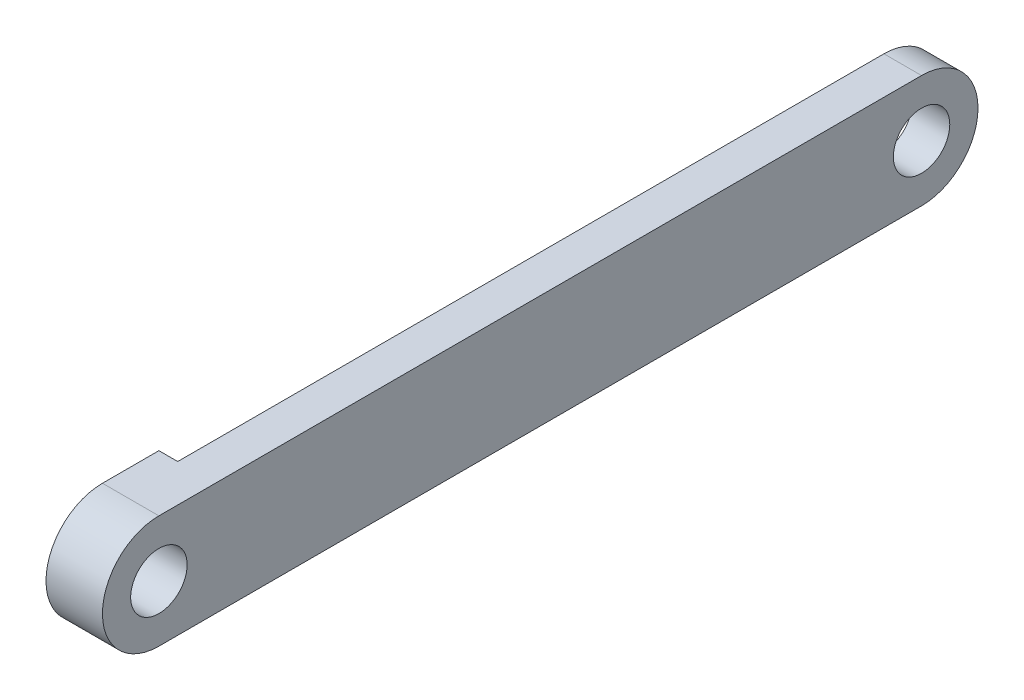
ISO-10303-21;
HEADER;
FILE_DESCRIPTION(('STEP AP214'),'2;1');
FILE_NAME('part.step','',(''),(''),'','','');
FILE_SCHEMA(('AUTOMOTIVE_DESIGN { 1 0 10303 214 1 1 1 1 }'));
ENDSEC;
DATA;
#1=APPLICATION_CONTEXT('core data for automotive mechanical design processes');
#2=APPLICATION_PROTOCOL_DEFINITION('international standard','automotive_design',2000,#1);
#3=PRODUCT_CONTEXT('',#1,'mechanical');
#4=PRODUCT('Part','Part','',(#3));
#5=PRODUCT_RELATED_PRODUCT_CATEGORY('part','',(#4));
#6=PRODUCT_DEFINITION_FORMATION('','',#4);
#7=PRODUCT_DEFINITION_CONTEXT('part definition',#1,'design');
#8=PRODUCT_DEFINITION('design','',#6,#7);
#9=PRODUCT_DEFINITION_SHAPE('','',#8);
#10=(LENGTH_UNIT() NAMED_UNIT(*) SI_UNIT(.MILLI.,.METRE.));
#11=(NAMED_UNIT(*) PLANE_ANGLE_UNIT() SI_UNIT($,.RADIAN.));
#12=(NAMED_UNIT(*) SI_UNIT($,.STERADIAN.) SOLID_ANGLE_UNIT());
#13=UNCERTAINTY_MEASURE_WITH_UNIT(LENGTH_MEASURE(1.E-05),#10,'distance_accuracy_value','');
#14=(GEOMETRIC_REPRESENTATION_CONTEXT(3) GLOBAL_UNCERTAINTY_ASSIGNED_CONTEXT((#13)) GLOBAL_UNIT_ASSIGNED_CONTEXT((#10,
#11,#12)) REPRESENTATION_CONTEXT('',''));
#15=CARTESIAN_POINT('',(0.,0.,0.));
#16=DIRECTION('',(0.,0.,1.));
#17=DIRECTION('',(1.,0.,0.));
#18=AXIS2_PLACEMENT_3D('',#15,#16,#17);
#19=CARTESIAN_POINT('',(0.,0.,0.));
#20=DIRECTION('',(-1.,0.,0.));
#21=DIRECTION('',(0.,0.,1.));
#22=AXIS2_PLACEMENT_3D('',#19,#20,#21);
#23=PLANE('',#22);
#24=CARTESIAN_POINT('',(0.,0.,0.));
#25=DIRECTION('',(1.,0.,0.));
#26=DIRECTION('',(0.,0.,-1.));
#27=AXIS2_PLACEMENT_3D('',#24,#25,#26);
#28=CIRCLE('',#27,1.5);
#29=CARTESIAN_POINT('',(0.,0.,-1.5));
#30=VERTEX_POINT('',#29);
#31=EDGE_CURVE('E142',#30,#30,#28,.T.);
#32=ORIENTED_EDGE('',*,*,#31,.T.);
#33=EDGE_LOOP('',(#32));
#34=FACE_BOUND('',#33,.T.);
#35=DIRECTION('',(0.,0.,1.));
#36=VECTOR('',#35,1.);
#37=CARTESIAN_POINT('',(0.,3.,0.));
#38=LINE('',#37,#36);
#39=CARTESIAN_POINT('',(0.,3.,-3.));
#40=VERTEX_POINT('',#39);
#41=CARTESIAN_POINT('',(0.,3.,0.));
#42=VERTEX_POINT('',#41);
#43=EDGE_CURVE('E86',#40,#42,#38,.T.);
#44=ORIENTED_EDGE('',*,*,#43,.F.);
#45=DIRECTION('',(0.,-1.,0.));
#46=VECTOR('',#45,1.);
#47=CARTESIAN_POINT('',(0.,3.,-3.));
#48=LINE('',#47,#46);
#49=CARTESIAN_POINT('',(0.,-3.,-3.));
#50=VERTEX_POINT('',#49);
#51=EDGE_CURVE('E114',#40,#50,#48,.T.);
#52=ORIENTED_EDGE('',*,*,#51,.T.);
#53=DIRECTION('',(0.,0.,-1.));
#54=VECTOR('',#53,1.);
#55=CARTESIAN_POINT('',(0.,-3.,0.));
#56=LINE('',#55,#54);
#57=CARTESIAN_POINT('',(0.,-3.,0.));
#58=VERTEX_POINT('',#57);
#59=EDGE_CURVE('E127',#58,#50,#56,.T.);
#60=ORIENTED_EDGE('',*,*,#59,.F.);
#61=CARTESIAN_POINT('',(0.,0.,0.));
#62=DIRECTION('',(1.,0.,0.));
#63=DIRECTION('',(0.,0.,1.));
#64=AXIS2_PLACEMENT_3D('',#61,#62,#63);
#65=CIRCLE('',#64,3.);
#66=EDGE_CURVE('E147',#42,#58,#65,.T.);
#67=ORIENTED_EDGE('',*,*,#66,.F.);
#68=EDGE_LOOP('',(#44,#52,#60,#67));
#69=FACE_BOUND('',#68,.T.);
#70=ADVANCED_FACE('F45',(#34,#69),#23,.T.);
#71=CARTESIAN_POINT('',(3.,-3.,0.));
#72=DIRECTION('',(0.,1.,0.));
#73=DIRECTION('',(0.,0.,1.));
#74=AXIS2_PLACEMENT_3D('',#71,#72,#73);
#75=PLANE('',#74);
#76=DIRECTION('',(-1.,0.,0.));
#77=VECTOR('',#76,1.);
#78=CARTESIAN_POINT('',(1.,-3.,-3.));
#79=LINE('',#78,#77);
#80=CARTESIAN_POINT('',(1.,-3.,-3.));
#81=VERTEX_POINT('',#80);
#82=EDGE_CURVE('E118',#81,#50,#79,.T.);
#83=ORIENTED_EDGE('',*,*,#82,.F.);
#84=DIRECTION('',(0.,0.,1.));
#85=VECTOR('',#84,1.);
#86=CARTESIAN_POINT('',(1.,-3.,-43.53));
#87=LINE('',#86,#85);
#88=CARTESIAN_POINT('',(1.,-3.,-40.53));
#89=VERTEX_POINT('',#88);
#90=EDGE_CURVE('E107',#89,#81,#87,.T.);
#91=ORIENTED_EDGE('',*,*,#90,.F.);
#92=DIRECTION('',(-1.,0.,0.));
#93=VECTOR('',#92,1.);
#94=CARTESIAN_POINT('',(3.,-3.,-40.53));
#95=LINE('',#94,#93);
#96=CARTESIAN_POINT('',(3.,-3.,-40.53));
#97=VERTEX_POINT('',#96);
#98=EDGE_CURVE('E55',#97,#89,#95,.T.);
#99=ORIENTED_EDGE('',*,*,#98,.F.);
#100=DIRECTION('',(0.,0.,-1.));
#101=VECTOR('',#100,1.);
#102=CARTESIAN_POINT('',(3.,-3.,0.));
#103=LINE('',#102,#101);
#104=CARTESIAN_POINT('',(3.,-3.,0.));
#105=VERTEX_POINT('',#104);
#106=EDGE_CURVE('E93',#105,#97,#103,.T.);
#107=ORIENTED_EDGE('',*,*,#106,.F.);
#108=DIRECTION('',(-1.,0.,0.));
#109=VECTOR('',#108,1.);
#110=CARTESIAN_POINT('',(3.,-3.,0.));
#111=LINE('',#110,#109);
#112=EDGE_CURVE('E11',#105,#58,#111,.T.);
#113=ORIENTED_EDGE('',*,*,#112,.T.);
#114=ORIENTED_EDGE('',*,*,#59,.T.);
#115=EDGE_LOOP('',(#83,#91,#99,#107,#113,#114));
#116=FACE_BOUND('',#115,.T.);
#117=ADVANCED_FACE('F126',(#116),#75,.F.);
#118=CARTESIAN_POINT('',(3.,0.,-40.53));
#119=DIRECTION('',(-1.,0.,0.));
#120=DIRECTION('',(0.,0.,1.));
#121=AXIS2_PLACEMENT_3D('',#118,#119,#120);
#122=CYLINDRICAL_SURFACE('',#121,3.);
#123=CARTESIAN_POINT('',(1.,0.,-40.53));
#124=DIRECTION('',(-1.,0.,0.));
#125=DIRECTION('',(0.,0.,1.));
#126=AXIS2_PLACEMENT_3D('',#123,#124,#125);
#127=CIRCLE('',#126,3.);
#128=CARTESIAN_POINT('',(1.,3.,-40.53));
#129=VERTEX_POINT('',#128);
#130=EDGE_CURVE('E110',#129,#89,#127,.T.);
#131=ORIENTED_EDGE('',*,*,#130,.F.);
#132=DIRECTION('',(-1.,0.,0.));
#133=VECTOR('',#132,1.);
#134=CARTESIAN_POINT('',(3.,3.,-40.53));
#135=LINE('',#134,#133);
#136=CARTESIAN_POINT('',(3.,3.,-40.53));
#137=VERTEX_POINT('',#136);
#138=EDGE_CURVE('E171',#137,#129,#135,.T.);
#139=ORIENTED_EDGE('',*,*,#138,.F.);
#140=CARTESIAN_POINT('',(3.,0.,-40.53));
#141=DIRECTION('',(1.,0.,0.));
#142=DIRECTION('',(0.,0.,1.));
#143=AXIS2_PLACEMENT_3D('',#140,#141,#142);
#144=CIRCLE('',#143,3.);
#145=EDGE_CURVE('E156',#97,#137,#144,.T.);
#146=ORIENTED_EDGE('',*,*,#145,.F.);
#147=ORIENTED_EDGE('',*,*,#98,.T.);
#148=EDGE_LOOP('',(#131,#139,#146,#147));
#149=FACE_BOUND('',#148,.T.);
#150=ADVANCED_FACE('F178',(#149),#122,.T.);
#151=CARTESIAN_POINT('',(3.,3.,0.));
#152=DIRECTION('',(0.,-1.,0.));
#153=DIRECTION('',(0.,0.,-1.));
#154=AXIS2_PLACEMENT_3D('',#151,#152,#153);
#155=PLANE('',#154);
#156=DIRECTION('',(-1.,0.,0.));
#157=VECTOR('',#156,1.);
#158=CARTESIAN_POINT('',(1.,3.,-3.));
#159=LINE('',#158,#157);
#160=CARTESIAN_POINT('',(1.,3.,-3.));
#161=VERTEX_POINT('',#160);
#162=EDGE_CURVE('E120',#161,#40,#159,.T.);
#163=ORIENTED_EDGE('',*,*,#162,.T.);
#164=ORIENTED_EDGE('',*,*,#43,.T.);
#165=DIRECTION('',(-1.,0.,0.));
#166=VECTOR('',#165,1.);
#167=CARTESIAN_POINT('',(3.,3.,0.));
#168=LINE('',#167,#166);
#169=CARTESIAN_POINT('',(3.,3.,0.));
#170=VERTEX_POINT('',#169);
#171=EDGE_CURVE('E161',#170,#42,#168,.T.);
#172=ORIENTED_EDGE('',*,*,#171,.F.);
#173=DIRECTION('',(0.,0.,1.));
#174=VECTOR('',#173,1.);
#175=CARTESIAN_POINT('',(3.,3.,0.));
#176=LINE('',#175,#174);
#177=EDGE_CURVE('E71',#137,#170,#176,.T.);
#178=ORIENTED_EDGE('',*,*,#177,.F.);
#179=ORIENTED_EDGE('',*,*,#138,.T.);
#180=DIRECTION('',(0.,0.,1.));
#181=VECTOR('',#180,1.);
#182=CARTESIAN_POINT('',(1.,3.,-43.53));
#183=LINE('',#182,#181);
#184=EDGE_CURVE('E123',#129,#161,#183,.T.);
#185=ORIENTED_EDGE('',*,*,#184,.T.);
#186=EDGE_LOOP('',(#163,#164,#172,#178,#179,#185));
#187=FACE_BOUND('',#186,.T.);
#188=ADVANCED_FACE('F188',(#187),#155,.F.);
#189=CARTESIAN_POINT('',(3.,0.,-40.53));
#190=DIRECTION('',(-1.,0.,0.));
#191=DIRECTION('',(0.,0.,1.));
#192=AXIS2_PLACEMENT_3D('',#189,#190,#191);
#193=CYLINDRICAL_SURFACE('',#192,1.5);
#194=CARTESIAN_POINT('',(3.,0.,-40.53));
#195=DIRECTION('',(1.,0.,0.));
#196=DIRECTION('',(0.,0.,-1.));
#197=AXIS2_PLACEMENT_3D('',#194,#195,#196);
#198=CIRCLE('',#197,1.5);
#199=CARTESIAN_POINT('',(3.,0.,-42.03));
#200=VERTEX_POINT('',#199);
#201=EDGE_CURVE('E138',#200,#200,#198,.T.);
#202=ORIENTED_EDGE('',*,*,#201,.T.);
#203=EDGE_LOOP('',(#202));
#204=FACE_BOUND('',#203,.T.);
#205=CARTESIAN_POINT('',(1.,0.,-40.53));
#206=DIRECTION('',(-1.,0.,0.));
#207=DIRECTION('',(0.,0.,1.));
#208=AXIS2_PLACEMENT_3D('',#205,#206,#207);
#209=CIRCLE('',#208,1.5);
#210=CARTESIAN_POINT('',(1.,0.,-39.03));
#211=VERTEX_POINT('',#210);
#212=EDGE_CURVE('E49',#211,#211,#209,.T.);
#213=ORIENTED_EDGE('',*,*,#212,.T.);
#214=EDGE_LOOP('',(#213));
#215=FACE_BOUND('',#214,.T.);
#216=ADVANCED_FACE('F190',(#204,#215),#193,.F.);
#217=CARTESIAN_POINT('',(3.,0.,0.));
#218=DIRECTION('',(-1.,0.,0.));
#219=DIRECTION('',(0.,0.,1.));
#220=AXIS2_PLACEMENT_3D('',#217,#218,#219);
#221=PLANE('',#220);
#222=CARTESIAN_POINT('',(3.,0.,0.));
#223=DIRECTION('',(1.,0.,0.));
#224=DIRECTION('',(0.,0.,1.));
#225=AXIS2_PLACEMENT_3D('',#222,#223,#224);
#226=CIRCLE('',#225,3.);
#227=EDGE_CURVE('E151',#170,#105,#226,.T.);
#228=ORIENTED_EDGE('',*,*,#227,.T.);
#229=ORIENTED_EDGE('',*,*,#106,.T.);
#230=ORIENTED_EDGE('',*,*,#145,.T.);
#231=ORIENTED_EDGE('',*,*,#177,.T.);
#232=EDGE_LOOP('',(#228,#229,#230,#231));
#233=FACE_BOUND('',#232,.T.);
#234=CARTESIAN_POINT('',(3.,0.,0.));
#235=DIRECTION('',(1.,0.,0.));
#236=DIRECTION('',(0.,0.,-1.));
#237=AXIS2_PLACEMENT_3D('',#234,#235,#236);
#238=CIRCLE('',#237,1.5);
#239=CARTESIAN_POINT('',(3.,0.,-1.5));
#240=VERTEX_POINT('',#239);
#241=EDGE_CURVE('E143',#240,#240,#238,.T.);
#242=ORIENTED_EDGE('',*,*,#241,.F.);
#243=EDGE_LOOP('',(#242));
#244=FACE_BOUND('',#243,.T.);
#245=ORIENTED_EDGE('',*,*,#201,.F.);
#246=EDGE_LOOP('',(#245));
#247=FACE_BOUND('',#246,.T.);
#248=ADVANCED_FACE('F180',(#233,#244,#247),#221,.F.);
#249=CARTESIAN_POINT('',(3.,0.,0.));
#250=DIRECTION('',(-1.,0.,0.));
#251=DIRECTION('',(0.,0.,1.));
#252=AXIS2_PLACEMENT_3D('',#249,#250,#251);
#253=CYLINDRICAL_SURFACE('',#252,3.);
#254=ORIENTED_EDGE('',*,*,#66,.T.);
#255=ORIENTED_EDGE('',*,*,#112,.F.);
#256=ORIENTED_EDGE('',*,*,#227,.F.);
#257=ORIENTED_EDGE('',*,*,#171,.T.);
#258=EDGE_LOOP('',(#254,#255,#256,#257));
#259=FACE_BOUND('',#258,.T.);
#260=ADVANCED_FACE('F47',(#259),#253,.T.);
#261=CARTESIAN_POINT('',(3.,0.,0.));
#262=DIRECTION('',(-1.,0.,0.));
#263=DIRECTION('',(0.,0.,1.));
#264=AXIS2_PLACEMENT_3D('',#261,#262,#263);
#265=CYLINDRICAL_SURFACE('',#264,1.5);
#266=ORIENTED_EDGE('',*,*,#241,.T.);
#267=EDGE_LOOP('',(#266));
#268=FACE_BOUND('',#267,.T.);
#269=ORIENTED_EDGE('',*,*,#31,.F.);
#270=EDGE_LOOP('',(#269));
#271=FACE_BOUND('',#270,.T.);
#272=ADVANCED_FACE('F209',(#268,#271),#265,.F.);
#273=CARTESIAN_POINT('',(1.,0.,0.));
#274=DIRECTION('',(-1.,0.,0.));
#275=DIRECTION('',(0.,0.,1.));
#276=AXIS2_PLACEMENT_3D('',#273,#274,#275);
#277=PLANE('',#276);
#278=ORIENTED_EDGE('',*,*,#212,.F.);
#279=EDGE_LOOP('',(#278));
#280=FACE_BOUND('',#279,.T.);
#281=ORIENTED_EDGE('',*,*,#130,.T.);
#282=ORIENTED_EDGE('',*,*,#90,.T.);
#283=DIRECTION('',(0.,-1.,0.));
#284=VECTOR('',#283,1.);
#285=CARTESIAN_POINT('',(1.,3.,-3.));
#286=LINE('',#285,#284);
#287=EDGE_CURVE('E62',#161,#81,#286,.T.);
#288=ORIENTED_EDGE('',*,*,#287,.F.);
#289=ORIENTED_EDGE('',*,*,#184,.F.);
#290=EDGE_LOOP('',(#281,#282,#288,#289));
#291=FACE_BOUND('',#290,.T.);
#292=ADVANCED_FACE('F108',(#280,#291),#277,.T.);
#293=CARTESIAN_POINT('',(1.,3.,-3.));
#294=DIRECTION('',(0.,0.,-1.));
#295=DIRECTION('',(-1.,0.,0.));
#296=AXIS2_PLACEMENT_3D('',#293,#294,#295);
#297=PLANE('',#296);
#298=ORIENTED_EDGE('',*,*,#51,.F.);
#299=ORIENTED_EDGE('',*,*,#162,.F.);
#300=ORIENTED_EDGE('',*,*,#287,.T.);
#301=ORIENTED_EDGE('',*,*,#82,.T.);
#302=EDGE_LOOP('',(#298,#299,#300,#301));
#303=FACE_BOUND('',#302,.T.);
#304=ADVANCED_FACE('F117',(#303),#297,.T.);
#305=CLOSED_SHELL('',(#70,#117,#150,#188,#216,#248,#260,#272,#292,#304));
#306=MANIFOLD_SOLID_BREP('B2',#305);
#307=ADVANCED_BREP_SHAPE_REPRESENTATION('',(#18,#306),#14);
#308=SHAPE_DEFINITION_REPRESENTATION(#9,#307);
ENDSEC;
END-ISO-10303-21;
